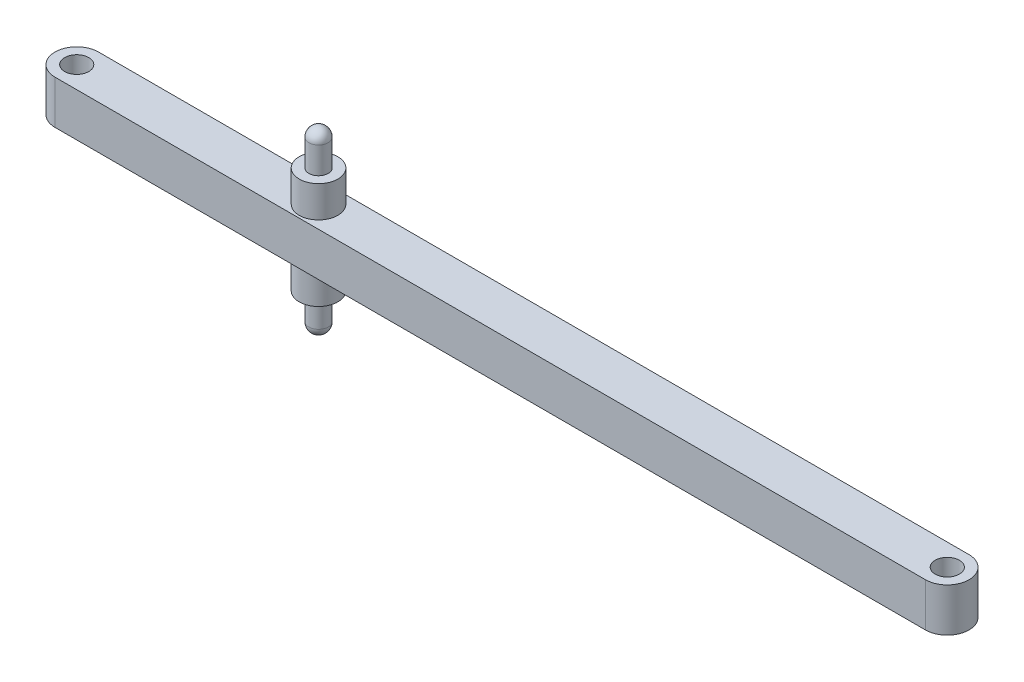
ISO-10303-21;
HEADER;
FILE_DESCRIPTION(('STEP AP214'),'2;1');
FILE_NAME('part.step','',(''),(''),'','','');
FILE_SCHEMA(('AUTOMOTIVE_DESIGN { 1 0 10303 214 1 1 1 1 }'));
ENDSEC;
DATA;
#1=APPLICATION_CONTEXT('core data for automotive mechanical design processes');
#2=APPLICATION_PROTOCOL_DEFINITION('international standard','automotive_design',2000,#1);
#3=PRODUCT_CONTEXT('',#1,'mechanical');
#4=PRODUCT('Part','Part','',(#3));
#5=PRODUCT_RELATED_PRODUCT_CATEGORY('part','',(#4));
#6=PRODUCT_DEFINITION_FORMATION('','',#4);
#7=PRODUCT_DEFINITION_CONTEXT('part definition',#1,'design');
#8=PRODUCT_DEFINITION('design','',#6,#7);
#9=PRODUCT_DEFINITION_SHAPE('','',#8);
#10=(LENGTH_UNIT() NAMED_UNIT(*) SI_UNIT(.MILLI.,.METRE.));
#11=(NAMED_UNIT(*) PLANE_ANGLE_UNIT() SI_UNIT($,.RADIAN.));
#12=(NAMED_UNIT(*) SI_UNIT($,.STERADIAN.) SOLID_ANGLE_UNIT());
#13=UNCERTAINTY_MEASURE_WITH_UNIT(LENGTH_MEASURE(1.E-05),#10,'distance_accuracy_value','');
#14=(GEOMETRIC_REPRESENTATION_CONTEXT(3) GLOBAL_UNCERTAINTY_ASSIGNED_CONTEXT((#13)) GLOBAL_UNIT_ASSIGNED_CONTEXT((#10,
#11,#12)) REPRESENTATION_CONTEXT('',''));
#15=CARTESIAN_POINT('',(0.,0.,0.));
#16=DIRECTION('',(0.,0.,1.));
#17=DIRECTION('',(1.,0.,0.));
#18=AXIS2_PLACEMENT_3D('',#15,#16,#17);
#19=CARTESIAN_POINT('',(-60.,-4.5,39.));
#20=DIRECTION('',(0.,1.,0.));
#21=DIRECTION('',(0.,0.,1.));
#22=AXIS2_PLACEMENT_3D('',#19,#20,#21);
#23=CYLINDRICAL_SURFACE('',#22,4.5);
#24=CARTESIAN_POINT('',(-60.,4.5,39.));
#25=DIRECTION('',(0.,1.,0.));
#26=DIRECTION('',(0.,0.,1.));
#27=AXIS2_PLACEMENT_3D('',#24,#25,#26);
#28=CIRCLE('',#27,4.5);
#29=CARTESIAN_POINT('',(-60.,4.5,34.5));
#30=VERTEX_POINT('',#29);
#31=CARTESIAN_POINT('',(-60.,4.5,43.5));
#32=VERTEX_POINT('',#31);
#33=EDGE_CURVE('E115',#30,#32,#28,.T.);
#34=ORIENTED_EDGE('',*,*,#33,.F.);
#35=DIRECTION('',(0.,1.,0.));
#36=VECTOR('',#35,1.);
#37=CARTESIAN_POINT('',(-60.,-4.5,34.5));
#38=LINE('',#37,#36);
#39=CARTESIAN_POINT('',(-60.,-4.5,34.5));
#40=VERTEX_POINT('',#39);
#41=EDGE_CURVE('E63',#40,#30,#38,.T.);
#42=ORIENTED_EDGE('',*,*,#41,.F.);
#43=CARTESIAN_POINT('',(-60.,-4.5,39.));
#44=DIRECTION('',(0.,1.,0.));
#45=DIRECTION('',(0.,0.,1.));
#46=AXIS2_PLACEMENT_3D('',#43,#44,#45);
#47=CIRCLE('',#46,4.5);
#48=CARTESIAN_POINT('',(-60.,-4.5,43.5));
#49=VERTEX_POINT('',#48);
#50=EDGE_CURVE('E108',#40,#49,#47,.T.);
#51=ORIENTED_EDGE('',*,*,#50,.T.);
#52=DIRECTION('',(0.,1.,0.));
#53=VECTOR('',#52,1.);
#54=CARTESIAN_POINT('',(-60.,-4.5,43.5));
#55=LINE('',#54,#53);
#56=EDGE_CURVE('E91',#49,#32,#55,.T.);
#57=ORIENTED_EDGE('',*,*,#56,.T.);
#58=EDGE_LOOP('',(#34,#42,#51,#57));
#59=FACE_BOUND('',#58,.T.);
#60=ADVANCED_FACE('F45',(#59),#23,.T.);
#61=CARTESIAN_POINT('',(120.,-4.5,34.5));
#62=DIRECTION('',(0.,0.,-1.));
#63=DIRECTION('',(-1.,0.,0.));
#64=AXIS2_PLACEMENT_3D('',#61,#62,#63);
#65=PLANE('',#64);
#66=DIRECTION('',(-1.,0.,0.));
#67=VECTOR('',#66,1.);
#68=CARTESIAN_POINT('',(120.,4.5,34.5));
#69=LINE('',#68,#67);
#70=CARTESIAN_POINT('',(120.,4.5,34.5));
#71=VERTEX_POINT('',#70);
#72=EDGE_CURVE('E110',#71,#30,#69,.T.);
#73=ORIENTED_EDGE('',*,*,#72,.F.);
#74=DIRECTION('',(0.,1.,0.));
#75=VECTOR('',#74,1.);
#76=CARTESIAN_POINT('',(120.,-4.5,34.5));
#77=LINE('',#76,#75);
#78=CARTESIAN_POINT('',(120.,-4.5,34.5));
#79=VERTEX_POINT('',#78);
#80=EDGE_CURVE('E80',#79,#71,#77,.T.);
#81=ORIENTED_EDGE('',*,*,#80,.F.);
#82=DIRECTION('',(-1.,0.,0.));
#83=VECTOR('',#82,1.);
#84=CARTESIAN_POINT('',(120.,-4.5,34.5));
#85=LINE('',#84,#83);
#86=EDGE_CURVE('E105',#79,#40,#85,.T.);
#87=ORIENTED_EDGE('',*,*,#86,.T.);
#88=ORIENTED_EDGE('',*,*,#41,.T.);
#89=EDGE_LOOP('',(#73,#81,#87,#88));
#90=FACE_BOUND('',#89,.T.);
#91=ADVANCED_FACE('F127',(#90),#65,.T.);
#92=CARTESIAN_POINT('',(120.,-4.5,39.));
#93=DIRECTION('',(0.,1.,0.));
#94=DIRECTION('',(0.,0.,1.));
#95=AXIS2_PLACEMENT_3D('',#92,#93,#94);
#96=CYLINDRICAL_SURFACE('',#95,4.5);
#97=CARTESIAN_POINT('',(120.,4.5,39.));
#98=DIRECTION('',(0.,1.,0.));
#99=DIRECTION('',(0.,0.,1.));
#100=AXIS2_PLACEMENT_3D('',#97,#98,#99);
#101=CIRCLE('',#100,4.5);
#102=CARTESIAN_POINT('',(120.,4.5,43.5));
#103=VERTEX_POINT('',#102);
#104=EDGE_CURVE('E99',#103,#71,#101,.T.);
#105=ORIENTED_EDGE('',*,*,#104,.F.);
#106=DIRECTION('',(0.,1.,0.));
#107=VECTOR('',#106,1.);
#108=CARTESIAN_POINT('',(120.,-4.5,43.5));
#109=LINE('',#108,#107);
#110=CARTESIAN_POINT('',(120.,-4.5,43.5));
#111=VERTEX_POINT('',#110);
#112=EDGE_CURVE('E94',#111,#103,#109,.T.);
#113=ORIENTED_EDGE('',*,*,#112,.F.);
#114=CARTESIAN_POINT('',(120.,-4.5,39.));
#115=DIRECTION('',(0.,1.,0.));
#116=DIRECTION('',(0.,0.,1.));
#117=AXIS2_PLACEMENT_3D('',#114,#115,#116);
#118=CIRCLE('',#117,4.5);
#119=EDGE_CURVE('E97',#111,#79,#118,.T.);
#120=ORIENTED_EDGE('',*,*,#119,.T.);
#121=ORIENTED_EDGE('',*,*,#80,.T.);
#122=EDGE_LOOP('',(#105,#113,#120,#121));
#123=FACE_BOUND('',#122,.T.);
#124=ADVANCED_FACE('F96',(#123),#96,.T.);
#125=CARTESIAN_POINT('',(-60.,-4.5,43.5));
#126=DIRECTION('',(0.,0.,1.));
#127=DIRECTION('',(1.,0.,0.));
#128=AXIS2_PLACEMENT_3D('',#125,#126,#127);
#129=PLANE('',#128);
#130=DIRECTION('',(1.,0.,0.));
#131=VECTOR('',#130,1.);
#132=CARTESIAN_POINT('',(-60.,4.5,43.5));
#133=LINE('',#132,#131);
#134=EDGE_CURVE('E118',#32,#103,#133,.T.);
#135=ORIENTED_EDGE('',*,*,#134,.F.);
#136=ORIENTED_EDGE('',*,*,#56,.F.);
#137=DIRECTION('',(1.,0.,0.));
#138=VECTOR('',#137,1.);
#139=CARTESIAN_POINT('',(-60.,-4.5,43.5));
#140=LINE('',#139,#138);
#141=EDGE_CURVE('E104',#49,#111,#140,.T.);
#142=ORIENTED_EDGE('',*,*,#141,.T.);
#143=ORIENTED_EDGE('',*,*,#112,.T.);
#144=EDGE_LOOP('',(#135,#136,#142,#143));
#145=FACE_BOUND('',#144,.T.);
#146=ADVANCED_FACE('F107',(#145),#129,.T.);
#147=CARTESIAN_POINT('',(-60.,-4.5,39.));
#148=DIRECTION('',(0.,1.,0.));
#149=DIRECTION('',(0.,0.,1.));
#150=AXIS2_PLACEMENT_3D('',#147,#148,#149);
#151=PLANE('',#150);
#152=CARTESIAN_POINT('',(-60.,-4.5,39.));
#153=DIRECTION('',(0.,1.,0.));
#154=DIRECTION('',(0.,0.,1.));
#155=AXIS2_PLACEMENT_3D('',#152,#153,#154);
#156=CIRCLE('',#155,2.49999999999999);
#157=CARTESIAN_POINT('',(-60.,-4.5,41.5));
#158=VERTEX_POINT('',#157);
#159=EDGE_CURVE('E195',#158,#158,#156,.T.);
#160=ORIENTED_EDGE('',*,*,#159,.T.);
#161=EDGE_LOOP('',(#160));
#162=FACE_BOUND('',#161,.T.);
#163=CARTESIAN_POINT('',(120.,-4.5,39.));
#164=DIRECTION('',(0.,1.,0.));
#165=DIRECTION('',(0.,0.,1.));
#166=AXIS2_PLACEMENT_3D('',#163,#164,#165);
#167=CIRCLE('',#166,2.5);
#168=CARTESIAN_POINT('',(120.,-4.5,41.5));
#169=VERTEX_POINT('',#168);
#170=EDGE_CURVE('E199',#169,#169,#167,.T.);
#171=ORIENTED_EDGE('',*,*,#170,.T.);
#172=EDGE_LOOP('',(#171));
#173=FACE_BOUND('',#172,.T.);
#174=CARTESIAN_POINT('',(-10.,-4.5,39.));
#175=DIRECTION('',(0.,1.,0.));
#176=DIRECTION('',(0.,0.,1.));
#177=AXIS2_PLACEMENT_3D('',#174,#175,#176);
#178=CIRCLE('',#177,4.);
#179=CARTESIAN_POINT('',(-10.,-4.5,43.));
#180=VERTEX_POINT('',#179);
#181=EDGE_CURVE('E48',#180,#180,#178,.F.);
#182=ORIENTED_EDGE('',*,*,#181,.F.);
#183=EDGE_LOOP('',(#182));
#184=FACE_BOUND('',#183,.T.);
#185=ORIENTED_EDGE('',*,*,#50,.F.);
#186=ORIENTED_EDGE('',*,*,#86,.F.);
#187=ORIENTED_EDGE('',*,*,#119,.F.);
#188=ORIENTED_EDGE('',*,*,#141,.F.);
#189=EDGE_LOOP('',(#185,#186,#187,#188));
#190=FACE_BOUND('',#189,.T.);
#191=ADVANCED_FACE('F103',(#162,#173,#184,#190),#151,.F.);
#192=CARTESIAN_POINT('',(-60.,4.5,39.));
#193=DIRECTION('',(0.,1.,0.));
#194=DIRECTION('',(0.,0.,1.));
#195=AXIS2_PLACEMENT_3D('',#192,#193,#194);
#196=PLANE('',#195);
#197=CARTESIAN_POINT('',(-60.,4.5,39.));
#198=DIRECTION('',(0.,1.,0.));
#199=DIRECTION('',(0.,0.,1.));
#200=AXIS2_PLACEMENT_3D('',#197,#198,#199);
#201=CIRCLE('',#200,2.49999999999999);
#202=CARTESIAN_POINT('',(-60.,4.5,41.5));
#203=VERTEX_POINT('',#202);
#204=EDGE_CURVE('E193',#203,#203,#201,.T.);
#205=ORIENTED_EDGE('',*,*,#204,.F.);
#206=EDGE_LOOP('',(#205));
#207=FACE_BOUND('',#206,.T.);
#208=CARTESIAN_POINT('',(120.,4.5,39.));
#209=DIRECTION('',(0.,1.,0.));
#210=DIRECTION('',(0.,0.,1.));
#211=AXIS2_PLACEMENT_3D('',#208,#209,#210);
#212=CIRCLE('',#211,2.49999999999999);
#213=CARTESIAN_POINT('',(120.,4.5,41.5));
#214=VERTEX_POINT('',#213);
#215=EDGE_CURVE('E196',#214,#214,#212,.T.);
#216=ORIENTED_EDGE('',*,*,#215,.F.);
#217=EDGE_LOOP('',(#216));
#218=FACE_BOUND('',#217,.T.);
#219=CARTESIAN_POINT('',(-10.,4.5,39.));
#220=DIRECTION('',(0.,1.,0.));
#221=DIRECTION('',(0.,0.,1.));
#222=AXIS2_PLACEMENT_3D('',#219,#220,#221);
#223=CIRCLE('',#222,4.);
#224=CARTESIAN_POINT('',(-10.,4.5,35.));
#225=VERTEX_POINT('',#224);
#226=EDGE_CURVE('E208',#225,#225,#223,.T.);
#227=ORIENTED_EDGE('',*,*,#226,.F.);
#228=EDGE_LOOP('',(#227));
#229=FACE_BOUND('',#228,.T.);
#230=ORIENTED_EDGE('',*,*,#33,.T.);
#231=ORIENTED_EDGE('',*,*,#134,.T.);
#232=ORIENTED_EDGE('',*,*,#104,.T.);
#233=ORIENTED_EDGE('',*,*,#72,.T.);
#234=EDGE_LOOP('',(#230,#231,#232,#233));
#235=FACE_BOUND('',#234,.T.);
#236=ADVANCED_FACE('F126',(#207,#218,#229,#235),#196,.T.);
#237=CARTESIAN_POINT('',(-10.,-11.,39.));
#238=DIRECTION('',(0.,1.,0.));
#239=DIRECTION('',(0.,0.,1.));
#240=AXIS2_PLACEMENT_3D('',#237,#238,#239);
#241=CYLINDRICAL_SURFACE('',#240,4.);
#242=CARTESIAN_POINT('',(-10.,-11.,39.));
#243=DIRECTION('',(0.,-1.,0.));
#244=DIRECTION('',(0.,0.,-1.));
#245=AXIS2_PLACEMENT_3D('',#242,#243,#244);
#246=CIRCLE('',#245,4.);
#247=CARTESIAN_POINT('',(-10.,-11.,43.));
#248=VERTEX_POINT('',#247);
#249=EDGE_CURVE('E119',#248,#248,#246,.T.);
#250=CARTESIAN_POINT('',(-10.,-11.,43.));
#251=CARTESIAN_POINT('',(-10.,-10.9322916666667,43.));
#252=CARTESIAN_POINT('',(-10.,-10.8645833333333,43.));
#253=CARTESIAN_POINT('',(-10.,-10.7291666666667,43.));
#254=CARTESIAN_POINT('',(-10.,-10.6614583333333,43.));
#255=CARTESIAN_POINT('',(-10.,-10.5260416666667,43.));
#256=CARTESIAN_POINT('',(-10.,-10.4583333333333,43.));
#257=CARTESIAN_POINT('',(-10.,-10.3229166666667,43.));
#258=CARTESIAN_POINT('',(-10.,-10.2552083333333,43.));
#259=CARTESIAN_POINT('',(-10.,-10.1197916666667,43.));
#260=CARTESIAN_POINT('',(-10.,-10.0520833333333,43.));
#261=CARTESIAN_POINT('',(-10.,-9.91666666666666,43.));
#262=CARTESIAN_POINT('',(-10.,-9.84895833333333,43.));
#263=CARTESIAN_POINT('',(-10.,-9.71354166666666,43.));
#264=CARTESIAN_POINT('',(-10.,-9.64583333333333,43.));
#265=CARTESIAN_POINT('',(-10.,-9.51041666666666,43.));
#266=CARTESIAN_POINT('',(-10.,-9.44270833333333,43.));
#267=CARTESIAN_POINT('',(-10.,-9.30729166666666,43.));
#268=CARTESIAN_POINT('',(-10.,-9.23958333333333,43.));
#269=CARTESIAN_POINT('',(-10.,-9.10416666666666,43.));
#270=CARTESIAN_POINT('',(-10.,-9.03645833333333,43.));
#271=CARTESIAN_POINT('',(-10.,-8.90104166666666,43.));
#272=CARTESIAN_POINT('',(-10.,-8.83333333333333,43.));
#273=CARTESIAN_POINT('',(-10.,-8.69791666666666,43.));
#274=CARTESIAN_POINT('',(-10.,-8.63020833333333,43.));
#275=CARTESIAN_POINT('',(-10.,-8.49479166666666,43.));
#276=CARTESIAN_POINT('',(-10.,-8.42708333333333,43.));
#277=CARTESIAN_POINT('',(-10.,-8.29166666666666,43.));
#278=CARTESIAN_POINT('',(-10.,-8.22395833333333,43.));
#279=CARTESIAN_POINT('',(-10.,-8.08854166666666,43.));
#280=CARTESIAN_POINT('',(-10.,-8.02083333333333,43.));
#281=CARTESIAN_POINT('',(-10.,-7.88541666666667,43.));
#282=CARTESIAN_POINT('',(-10.,-7.81770833333333,43.));
#283=CARTESIAN_POINT('',(-10.,-7.68229166666666,43.));
#284=CARTESIAN_POINT('',(-10.,-7.61458333333333,43.));
#285=CARTESIAN_POINT('',(-10.,-7.47916666666666,43.));
#286=CARTESIAN_POINT('',(-10.,-7.41145833333333,43.));
#287=CARTESIAN_POINT('',(-10.,-7.27604166666666,43.));
#288=CARTESIAN_POINT('',(-10.,-7.20833333333333,43.));
#289=CARTESIAN_POINT('',(-10.,-7.07291666666666,43.));
#290=CARTESIAN_POINT('',(-10.,-7.00520833333333,43.));
#291=CARTESIAN_POINT('',(-10.,-6.86979166666666,43.));
#292=CARTESIAN_POINT('',(-10.,-6.80208333333333,43.));
#293=CARTESIAN_POINT('',(-10.,-6.66666666666666,43.));
#294=CARTESIAN_POINT('',(-10.,-6.59895833333333,43.));
#295=CARTESIAN_POINT('',(-10.,-6.46354166666666,43.));
#296=CARTESIAN_POINT('',(-10.,-6.39583333333333,43.));
#297=CARTESIAN_POINT('',(-10.,-6.26041666666666,43.));
#298=CARTESIAN_POINT('',(-10.,-6.19270833333333,43.));
#299=CARTESIAN_POINT('',(-10.,-6.05729166666666,43.));
#300=CARTESIAN_POINT('',(-10.,-5.98958333333333,43.));
#301=CARTESIAN_POINT('',(-10.,-5.85416666666666,43.));
#302=CARTESIAN_POINT('',(-10.,-5.78645833333333,43.));
#303=CARTESIAN_POINT('',(-10.,-5.65104166666666,43.));
#304=CARTESIAN_POINT('',(-10.,-5.58333333333333,43.));
#305=CARTESIAN_POINT('',(-10.,-5.44791666666666,43.));
#306=CARTESIAN_POINT('',(-10.,-5.38020833333333,43.));
#307=CARTESIAN_POINT('',(-10.,-5.24479166666666,43.));
#308=CARTESIAN_POINT('',(-10.,-5.17708333333333,43.));
#309=CARTESIAN_POINT('',(-10.,-5.04166666666667,43.));
#310=CARTESIAN_POINT('',(-10.,-4.97395833333333,43.));
#311=CARTESIAN_POINT('',(-10.,-4.83854166666666,43.));
#312=CARTESIAN_POINT('',(-10.,-4.77083333333333,43.));
#313=CARTESIAN_POINT('',(-10.,-4.63541666666666,43.));
#314=CARTESIAN_POINT('',(-10.,-4.56770833333333,43.));
#315=CARTESIAN_POINT('',(-10.,-4.5,43.));
#316=B_SPLINE_CURVE_WITH_KNOTS('',3,(#250,#251,#252,#253,#254,#255,#256,#257,#258,#259,#260,
#261,#262,#263,#264,#265,#266,#267,#268,#269,#270,#271,#272,#273,#274,#275,#276,#277,#278,#279,
#280,#281,#282,#283,#284,#285,#286,#287,#288,#289,#290,#291,#292,#293,#294,#295,#296,#297,#298,
#299,#300,#301,#302,#303,#304,#305,#306,#307,#308,#309,#310,#311,#312,#313,#314,#315),
.UNSPECIFIED.,.F.,.F.,(4,2,2,2,2,2,2,2,2,2,2,2,2,2,2,2,2,2,2,2,2,2,2,2,2,2,2,2,2,2,2,2,4),(0.,
0.203124999999998,0.406249999999999,0.609374999999999,0.812499999999999,1.015625,1.21875,
1.421875,1.625,1.828125,2.03125,2.234375,2.4375,2.640625,2.84375,3.046875,3.25,3.453125,3.65625,
3.859375,4.0625,4.265625,4.46875,4.671875,4.875,5.078125,5.28125,5.484375,5.6875,5.890625,
6.09375,6.296875,6.5),.UNSPECIFIED.);
#317=EDGE_CURVE('BSEAM147',#248,#180,#316,.T.);
#318=ORIENTED_EDGE('',*,*,#249,.F.);
#319=ORIENTED_EDGE('',*,*,#181,.T.);
#320=ORIENTED_EDGE('',*,*,#317,.T.);
#321=ORIENTED_EDGE('',*,*,#317,.F.);
#322=EDGE_LOOP('',(#318,#320,#319,#321));
#323=FACE_BOUND('',#322,.T.);
#324=ADVANCED_FACE('F147',(#323),#241,.T.);
#325=CARTESIAN_POINT('',(-10.,-11.,39.));
#326=DIRECTION('',(0.,-1.,0.));
#327=DIRECTION('',(0.,0.,-1.));
#328=AXIS2_PLACEMENT_3D('',#325,#326,#327);
#329=PLANE('',#328);
#330=CARTESIAN_POINT('',(-10.,-11.,39.));
#331=DIRECTION('',(0.,-1.,0.));
#332=DIRECTION('',(0.,0.,-1.));
#333=AXIS2_PLACEMENT_3D('',#330,#331,#332);
#334=CIRCLE('',#333,2.);
#335=CARTESIAN_POINT('',(-10.,-11.,37.));
#336=VERTEX_POINT('',#335);
#337=EDGE_CURVE('E54',#336,#336,#334,.T.);
#338=ORIENTED_EDGE('',*,*,#337,.F.);
#339=EDGE_LOOP('',(#338));
#340=FACE_BOUND('',#339,.T.);
#341=ORIENTED_EDGE('',*,*,#249,.T.);
#342=EDGE_LOOP('',(#341));
#343=FACE_BOUND('',#342,.T.);
#344=ADVANCED_FACE('F153',(#340,#343),#329,.T.);
#345=CARTESIAN_POINT('',(-10.,-54.1972221329104,39.));
#346=DIRECTION('',(0.,1.,0.));
#347=DIRECTION('',(0.,0.,1.));
#348=AXIS2_PLACEMENT_3D('',#345,#346,#347);
#349=CYLINDRICAL_SURFACE('',#348,2.);
#350=ORIENTED_EDGE('',*,*,#337,.T.);
#351=EDGE_LOOP('',(#350));
#352=FACE_BOUND('',#351,.T.);
#353=CARTESIAN_POINT('',(-10.,-16.5,39.));
#354=DIRECTION('',(0.,1.,0.));
#355=DIRECTION('',(0.,0.,1.));
#356=AXIS2_PLACEMENT_3D('',#353,#354,#355);
#357=CIRCLE('',#356,2.);
#358=CARTESIAN_POINT('',(-10.,-16.5,41.));
#359=VERTEX_POINT('',#358);
#360=EDGE_CURVE('E213',#359,#359,#357,.F.);
#361=ORIENTED_EDGE('',*,*,#360,.F.);
#362=EDGE_LOOP('',(#361));
#363=FACE_BOUND('',#362,.T.);
#364=ADVANCED_FACE('F157',(#352,#363),#349,.T.);
#365=CARTESIAN_POINT('',(-10.,-16.5,39.));
#366=DIRECTION('',(0.,1.,0.));
#367=DIRECTION('',(1.,0.,0.));
#368=AXIS2_PLACEMENT_3D('',#365,#366,#367);
#369=SPHERICAL_SURFACE('',#368,2.);
#370=ORIENTED_EDGE('',*,*,#360,.T.);
#371=EDGE_LOOP('',(#370));
#372=FACE_BOUND('',#371,.T.);
#373=ADVANCED_FACE('F159',(#372),#369,.T.);
#374=CARTESIAN_POINT('',(-10.,11.,39.));
#375=DIRECTION('',(0.,-1.,0.));
#376=DIRECTION('',(0.,0.,-1.));
#377=AXIS2_PLACEMENT_3D('',#374,#375,#376);
#378=CYLINDRICAL_SURFACE('',#377,4.);
#379=CARTESIAN_POINT('',(-10.,11.,39.));
#380=DIRECTION('',(0.,1.,0.));
#381=DIRECTION('',(0.,0.,1.));
#382=AXIS2_PLACEMENT_3D('',#379,#380,#381);
#383=CIRCLE('',#382,4.);
#384=CARTESIAN_POINT('',(-10.,11.,35.));
#385=VERTEX_POINT('',#384);
#386=EDGE_CURVE('E210',#385,#385,#383,.T.);
#387=CARTESIAN_POINT('',(-10.,11.,35.));
#388=CARTESIAN_POINT('',(-10.,10.9322916666667,35.));
#389=CARTESIAN_POINT('',(-10.,10.8645833333333,35.));
#390=CARTESIAN_POINT('',(-10.,10.7291666666667,35.));
#391=CARTESIAN_POINT('',(-10.,10.6614583333333,35.));
#392=CARTESIAN_POINT('',(-10.,10.5260416666667,35.));
#393=CARTESIAN_POINT('',(-10.,10.4583333333333,35.));
#394=CARTESIAN_POINT('',(-10.,10.3229166666667,35.));
#395=CARTESIAN_POINT('',(-10.,10.2552083333333,35.));
#396=CARTESIAN_POINT('',(-10.,10.1197916666667,35.));
#397=CARTESIAN_POINT('',(-10.,10.0520833333333,35.));
#398=CARTESIAN_POINT('',(-10.,9.91666666666667,35.));
#399=CARTESIAN_POINT('',(-10.,9.84895833333333,35.));
#400=CARTESIAN_POINT('',(-10.,9.71354166666667,35.));
#401=CARTESIAN_POINT('',(-10.,9.64583333333333,35.));
#402=CARTESIAN_POINT('',(-10.,9.51041666666667,35.));
#403=CARTESIAN_POINT('',(-10.,9.44270833333333,35.));
#404=CARTESIAN_POINT('',(-10.,9.30729166666666,35.));
#405=CARTESIAN_POINT('',(-10.,9.23958333333333,35.));
#406=CARTESIAN_POINT('',(-10.,9.10416666666667,35.));
#407=CARTESIAN_POINT('',(-10.,9.03645833333333,35.));
#408=CARTESIAN_POINT('',(-10.,8.90104166666667,35.));
#409=CARTESIAN_POINT('',(-10.,8.83333333333333,35.));
#410=CARTESIAN_POINT('',(-10.,8.69791666666667,35.));
#411=CARTESIAN_POINT('',(-10.,8.63020833333333,35.));
#412=CARTESIAN_POINT('',(-10.,8.49479166666667,35.));
#413=CARTESIAN_POINT('',(-10.,8.42708333333333,35.));
#414=CARTESIAN_POINT('',(-10.,8.29166666666667,35.));
#415=CARTESIAN_POINT('',(-10.,8.22395833333333,35.));
#416=CARTESIAN_POINT('',(-10.,8.08854166666667,35.));
#417=CARTESIAN_POINT('',(-10.,8.02083333333333,35.));
#418=CARTESIAN_POINT('',(-10.,7.88541666666667,35.));
#419=CARTESIAN_POINT('',(-10.,7.81770833333333,35.));
#420=CARTESIAN_POINT('',(-10.,7.68229166666667,35.));
#421=CARTESIAN_POINT('',(-10.,7.61458333333333,35.));
#422=CARTESIAN_POINT('',(-10.,7.47916666666667,35.));
#423=CARTESIAN_POINT('',(-10.,7.41145833333333,35.));
#424=CARTESIAN_POINT('',(-10.,7.27604166666667,35.));
#425=CARTESIAN_POINT('',(-10.,7.20833333333333,35.));
#426=CARTESIAN_POINT('',(-10.,7.07291666666667,35.));
#427=CARTESIAN_POINT('',(-10.,7.00520833333333,35.));
#428=CARTESIAN_POINT('',(-10.,6.86979166666667,35.));
#429=CARTESIAN_POINT('',(-10.,6.80208333333333,35.));
#430=CARTESIAN_POINT('',(-10.,6.66666666666667,35.));
#431=CARTESIAN_POINT('',(-10.,6.59895833333333,35.));
#432=CARTESIAN_POINT('',(-10.,6.46354166666667,35.));
#433=CARTESIAN_POINT('',(-10.,6.39583333333333,35.));
#434=CARTESIAN_POINT('',(-10.,6.26041666666667,35.));
#435=CARTESIAN_POINT('',(-10.,6.19270833333333,35.));
#436=CARTESIAN_POINT('',(-10.,6.05729166666667,35.));
#437=CARTESIAN_POINT('',(-10.,5.98958333333333,35.));
#438=CARTESIAN_POINT('',(-10.,5.85416666666667,35.));
#439=CARTESIAN_POINT('',(-10.,5.78645833333333,35.));
#440=CARTESIAN_POINT('',(-10.,5.65104166666667,35.));
#441=CARTESIAN_POINT('',(-10.,5.58333333333333,35.));
#442=CARTESIAN_POINT('',(-10.,5.44791666666667,35.));
#443=CARTESIAN_POINT('',(-10.,5.38020833333333,35.));
#444=CARTESIAN_POINT('',(-10.,5.24479166666667,35.));
#445=CARTESIAN_POINT('',(-10.,5.17708333333333,35.));
#446=CARTESIAN_POINT('',(-10.,5.04166666666667,35.));
#447=CARTESIAN_POINT('',(-10.,4.97395833333333,35.));
#448=CARTESIAN_POINT('',(-10.,4.83854166666667,35.));
#449=CARTESIAN_POINT('',(-10.,4.77083333333333,35.));
#450=CARTESIAN_POINT('',(-10.,4.63541666666667,35.));
#451=CARTESIAN_POINT('',(-10.,4.56770833333333,35.));
#452=CARTESIAN_POINT('',(-10.,4.5,35.));
#453=B_SPLINE_CURVE_WITH_KNOTS('',3,(#387,#388,#389,#390,#391,#392,#393,#394,#395,#396,#397,
#398,#399,#400,#401,#402,#403,#404,#405,#406,#407,#408,#409,#410,#411,#412,#413,#414,#415,#416,
#417,#418,#419,#420,#421,#422,#423,#424,#425,#426,#427,#428,#429,#430,#431,#432,#433,#434,#435,
#436,#437,#438,#439,#440,#441,#442,#443,#444,#445,#446,#447,#448,#449,#450,#451,#452),
.UNSPECIFIED.,.F.,.F.,(4,2,2,2,2,2,2,2,2,2,2,2,2,2,2,2,2,2,2,2,2,2,2,2,2,2,2,2,2,2,2,2,4),(0.,
0.203124999999998,0.406249999999999,0.609374999999999,0.812499999999999,1.015625,1.21875,
1.421875,1.625,1.828125,2.03125,2.234375,2.4375,2.640625,2.84375,3.046875,3.25,3.453125,3.65625,
3.859375,4.0625,4.265625,4.46875,4.671875,4.875,5.078125,5.28125,5.484375,5.6875,5.890625,
6.09375,6.296875,6.5),.UNSPECIFIED.);
#454=EDGE_CURVE('BSEAM162',#385,#225,#453,.T.);
#455=ORIENTED_EDGE('',*,*,#386,.F.);
#456=ORIENTED_EDGE('',*,*,#226,.T.);
#457=ORIENTED_EDGE('',*,*,#454,.T.);
#458=ORIENTED_EDGE('',*,*,#454,.F.);
#459=EDGE_LOOP('',(#455,#457,#456,#458));
#460=FACE_BOUND('',#459,.T.);
#461=ADVANCED_FACE('F162',(#460),#378,.T.);
#462=CARTESIAN_POINT('',(-10.,11.,39.));
#463=DIRECTION('',(0.,1.,0.));
#464=DIRECTION('',(0.,0.,1.));
#465=AXIS2_PLACEMENT_3D('',#462,#463,#464);
#466=PLANE('',#465);
#467=CARTESIAN_POINT('',(-10.,11.,39.));
#468=DIRECTION('',(0.,1.,0.));
#469=DIRECTION('',(0.,0.,1.));
#470=AXIS2_PLACEMENT_3D('',#467,#468,#469);
#471=CIRCLE('',#470,2.);
#472=CARTESIAN_POINT('',(-10.,11.,41.));
#473=VERTEX_POINT('',#472);
#474=EDGE_CURVE('E11',#473,#473,#471,.T.);
#475=ORIENTED_EDGE('',*,*,#474,.F.);
#476=EDGE_LOOP('',(#475));
#477=FACE_BOUND('',#476,.T.);
#478=ORIENTED_EDGE('',*,*,#386,.T.);
#479=EDGE_LOOP('',(#478));
#480=FACE_BOUND('',#479,.T.);
#481=ADVANCED_FACE('F169',(#477,#480),#466,.T.);
#482=CARTESIAN_POINT('',(-10.,54.1972221329104,39.));
#483=DIRECTION('',(0.,-1.,0.));
#484=DIRECTION('',(0.,0.,-1.));
#485=AXIS2_PLACEMENT_3D('',#482,#483,#484);
#486=CYLINDRICAL_SURFACE('',#485,2.);
#487=ORIENTED_EDGE('',*,*,#474,.T.);
#488=EDGE_LOOP('',(#487));
#489=FACE_BOUND('',#488,.T.);
#490=CARTESIAN_POINT('',(-10.,16.5,39.));
#491=DIRECTION('',(0.,-1.,0.));
#492=DIRECTION('',(0.,0.,-1.));
#493=AXIS2_PLACEMENT_3D('',#490,#491,#492);
#494=CIRCLE('',#493,2.);
#495=CARTESIAN_POINT('',(-10.,16.5,37.));
#496=VERTEX_POINT('',#495);
#497=EDGE_CURVE('E205',#496,#496,#494,.F.);
#498=ORIENTED_EDGE('',*,*,#497,.F.);
#499=EDGE_LOOP('',(#498));
#500=FACE_BOUND('',#499,.T.);
#501=ADVANCED_FACE('F173',(#489,#500),#486,.T.);
#502=CARTESIAN_POINT('',(-10.,16.5,39.));
#503=DIRECTION('',(0.,1.,0.));
#504=DIRECTION('',(1.,0.,0.));
#505=AXIS2_PLACEMENT_3D('',#502,#503,#504);
#506=SPHERICAL_SURFACE('',#505,2.);
#507=ORIENTED_EDGE('',*,*,#497,.T.);
#508=EDGE_LOOP('',(#507));
#509=FACE_BOUND('',#508,.T.);
#510=ADVANCED_FACE('F175',(#509),#506,.T.);
#511=CARTESIAN_POINT('',(120.,4.5,39.));
#512=DIRECTION('',(0.,1.,0.));
#513=DIRECTION('',(0.,0.,1.));
#514=AXIS2_PLACEMENT_3D('',#511,#512,#513);
#515=CYLINDRICAL_SURFACE('',#514,2.5);
#516=ORIENTED_EDGE('',*,*,#215,.T.);
#517=EDGE_LOOP('',(#516));
#518=FACE_BOUND('',#517,.T.);
#519=ORIENTED_EDGE('',*,*,#170,.F.);
#520=EDGE_LOOP('',(#519));
#521=FACE_BOUND('',#520,.T.);
#522=ADVANCED_FACE('F177',(#518,#521),#515,.F.);
#523=CARTESIAN_POINT('',(-60.,4.5,39.));
#524=DIRECTION('',(0.,1.,0.));
#525=DIRECTION('',(0.,0.,1.));
#526=AXIS2_PLACEMENT_3D('',#523,#524,#525);
#527=CYLINDRICAL_SURFACE('',#526,2.49999999999999);
#528=ORIENTED_EDGE('',*,*,#204,.T.);
#529=EDGE_LOOP('',(#528));
#530=FACE_BOUND('',#529,.T.);
#531=ORIENTED_EDGE('',*,*,#159,.F.);
#532=EDGE_LOOP('',(#531));
#533=FACE_BOUND('',#532,.T.);
#534=ADVANCED_FACE('F184',(#530,#533),#527,.F.);
#535=CLOSED_SHELL('',(#60,#91,#124,#146,#191,#236,#324,#344,#364,#373,#461,#481,#501,#510,#522,#534));
#536=MANIFOLD_SOLID_BREP('B2',#535);
#537=ADVANCED_BREP_SHAPE_REPRESENTATION('',(#18,#536),#14);
#538=SHAPE_DEFINITION_REPRESENTATION(#9,#537);
ENDSEC;
END-ISO-10303-21;
